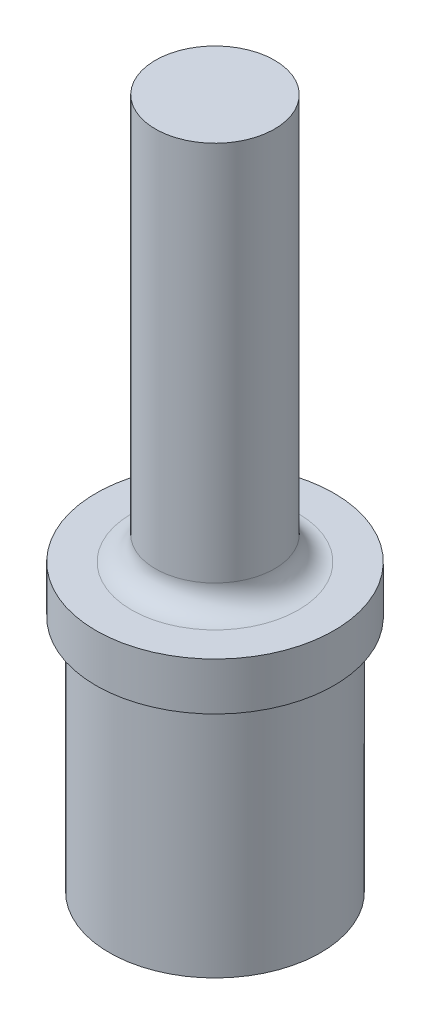
ISO-10303-21;
HEADER;
FILE_DESCRIPTION(('STEP AP214'),'2;1');
FILE_NAME('part.step','',(''),(''),'','','');
FILE_SCHEMA(('AUTOMOTIVE_DESIGN { 1 0 10303 214 1 1 1 1 }'));
ENDSEC;
DATA;
#1=APPLICATION_CONTEXT('core data for automotive mechanical design processes');
#2=APPLICATION_PROTOCOL_DEFINITION('international standard','automotive_design',2000,#1);
#3=PRODUCT_CONTEXT('',#1,'mechanical');
#4=PRODUCT('Part','Part','',(#3));
#5=PRODUCT_RELATED_PRODUCT_CATEGORY('part','',(#4));
#6=PRODUCT_DEFINITION_FORMATION('','',#4);
#7=PRODUCT_DEFINITION_CONTEXT('part definition',#1,'design');
#8=PRODUCT_DEFINITION('design','',#6,#7);
#9=PRODUCT_DEFINITION_SHAPE('','',#8);
#10=(LENGTH_UNIT() NAMED_UNIT(*) SI_UNIT(.MILLI.,.METRE.));
#11=(NAMED_UNIT(*) PLANE_ANGLE_UNIT() SI_UNIT($,.RADIAN.));
#12=(NAMED_UNIT(*) SI_UNIT($,.STERADIAN.) SOLID_ANGLE_UNIT());
#13=UNCERTAINTY_MEASURE_WITH_UNIT(LENGTH_MEASURE(1.E-05),#10,'distance_accuracy_value','');
#14=(GEOMETRIC_REPRESENTATION_CONTEXT(3) GLOBAL_UNCERTAINTY_ASSIGNED_CONTEXT((#13)) GLOBAL_UNIT_ASSIGNED_CONTEXT((#10,
#11,#12)) REPRESENTATION_CONTEXT('',''));
#15=CARTESIAN_POINT('',(0.,0.,0.));
#16=DIRECTION('',(0.,0.,1.));
#17=DIRECTION('',(1.,0.,0.));
#18=AXIS2_PLACEMENT_3D('',#15,#16,#17);
#19=CARTESIAN_POINT('',(0.,0.,0.));
#20=DIRECTION('',(0.,-1.,0.));
#21=DIRECTION('',(0.,0.,-1.));
#22=AXIS2_PLACEMENT_3D('',#19,#20,#21);
#23=PLANE('',#22);
#24=CARTESIAN_POINT('',(0.,0.,0.));
#25=DIRECTION('',(0.,-1.,0.));
#26=DIRECTION('',(0.,0.,-1.));
#27=AXIS2_PLACEMENT_3D('',#24,#25,#26);
#28=CIRCLE('',#27,3.9751);
#29=CARTESIAN_POINT('',(0.,0.,-3.9751));
#30=VERTEX_POINT('',#29);
#31=EDGE_CURVE('E78',#30,#30,#28,.T.);
#32=ORIENTED_EDGE('',*,*,#31,.F.);
#33=EDGE_LOOP('',(#32));
#34=FACE_BOUND('',#33,.T.);
#35=ADVANCED_FACE('F34',(#34),#23,.F.);
#36=CARTESIAN_POINT('',(0.,0.,0.));
#37=DIRECTION('',(0.,-1.,0.));
#38=DIRECTION('',(0.,0.,-1.));
#39=AXIS2_PLACEMENT_3D('',#36,#37,#38);
#40=CYLINDRICAL_SURFACE('',#39,3.9751);
#41=CARTESIAN_POINT('',(0.,-25.4,0.));
#42=DIRECTION('',(0.,-1.,0.));
#43=DIRECTION('',(0.,0.,-1.));
#44=AXIS2_PLACEMENT_3D('',#41,#42,#43);
#45=CIRCLE('',#44,3.9751);
#46=CARTESIAN_POINT('',(0.,-25.4,-3.9751));
#47=VERTEX_POINT('',#46);
#48=EDGE_CURVE('E11',#47,#47,#45,.F.);
#49=ORIENTED_EDGE('',*,*,#48,.T.);
#50=EDGE_LOOP('',(#49));
#51=FACE_BOUND('',#50,.T.);
#52=ORIENTED_EDGE('',*,*,#31,.T.);
#53=EDGE_LOOP('',(#52));
#54=FACE_BOUND('',#53,.T.);
#55=ADVANCED_FACE('F93',(#51,#54),#40,.T.);
#56=CARTESIAN_POINT('',(-3.9751,-26.9875,0.));
#57=DIRECTION('',(0.,-1.,0.));
#58=DIRECTION('',(0.,0.,-1.));
#59=AXIS2_PLACEMENT_3D('',#56,#57,#58);
#60=PLANE('',#59);
#61=CARTESIAN_POINT('',(0.,-26.9875,0.));
#62=DIRECTION('',(0.,-1.,0.));
#63=DIRECTION('',(0.,0.,-1.));
#64=AXIS2_PLACEMENT_3D('',#61,#62,#63);
#65=CIRCLE('',#64,5.5626);
#66=CARTESIAN_POINT('',(0.,-26.9875,-5.5626));
#67=VERTEX_POINT('',#66);
#68=EDGE_CURVE('E42',#67,#67,#65,.T.);
#69=ORIENTED_EDGE('',*,*,#68,.T.);
#70=EDGE_LOOP('',(#69));
#71=FACE_BOUND('',#70,.T.);
#72=CARTESIAN_POINT('',(0.,-26.9875,0.));
#73=DIRECTION('',(0.,-1.,0.));
#74=DIRECTION('',(0.,0.,-1.));
#75=AXIS2_PLACEMENT_3D('',#72,#73,#74);
#76=CIRCLE('',#75,7.9375);
#77=CARTESIAN_POINT('',(0.,-26.9875,-7.9375));
#78=VERTEX_POINT('',#77);
#79=EDGE_CURVE('E74',#78,#78,#76,.T.);
#80=ORIENTED_EDGE('',*,*,#79,.F.);
#81=EDGE_LOOP('',(#80));
#82=FACE_BOUND('',#81,.T.);
#83=ADVANCED_FACE('F84',(#71,#82),#60,.F.);
#84=CARTESIAN_POINT('',(0.,0.,0.));
#85=DIRECTION('',(0.,-1.,0.));
#86=DIRECTION('',(0.,0.,-1.));
#87=AXIS2_PLACEMENT_3D('',#84,#85,#86);
#88=CYLINDRICAL_SURFACE('',#87,7.9375);
#89=CARTESIAN_POINT('',(0.,-30.1625,0.));
#90=DIRECTION('',(0.,-1.,0.));
#91=DIRECTION('',(0.,0.,-1.));
#92=AXIS2_PLACEMENT_3D('',#89,#90,#91);
#93=CIRCLE('',#92,7.9375);
#94=CARTESIAN_POINT('',(0.,-30.1625,-7.9375));
#95=VERTEX_POINT('',#94);
#96=EDGE_CURVE('E70',#95,#95,#93,.T.);
#97=ORIENTED_EDGE('',*,*,#96,.F.);
#98=EDGE_LOOP('',(#97));
#99=FACE_BOUND('',#98,.T.);
#100=ORIENTED_EDGE('',*,*,#79,.T.);
#101=EDGE_LOOP('',(#100));
#102=FACE_BOUND('',#101,.T.);
#103=ADVANCED_FACE('F104',(#99,#102),#88,.T.);
#104=CARTESIAN_POINT('',(-7.9375,-30.1625,0.));
#105=DIRECTION('',(0.,1.,0.));
#106=DIRECTION('',(0.,0.,1.));
#107=AXIS2_PLACEMENT_3D('',#104,#105,#106);
#108=PLANE('',#107);
#109=CARTESIAN_POINT('',(0.,-30.1625,0.));
#110=DIRECTION('',(0.,-1.,0.));
#111=DIRECTION('',(0.,0.,-1.));
#112=AXIS2_PLACEMENT_3D('',#109,#110,#111);
#113=CIRCLE('',#112,7.0485);
#114=CARTESIAN_POINT('',(0.,-30.1625,-7.0485));
#115=VERTEX_POINT('',#114);
#116=EDGE_CURVE('E67',#115,#115,#113,.T.);
#117=ORIENTED_EDGE('',*,*,#116,.F.);
#118=EDGE_LOOP('',(#117));
#119=FACE_BOUND('',#118,.T.);
#120=ORIENTED_EDGE('',*,*,#96,.T.);
#121=EDGE_LOOP('',(#120));
#122=FACE_BOUND('',#121,.T.);
#123=ADVANCED_FACE('F107',(#119,#122),#108,.F.);
#124=CARTESIAN_POINT('',(0.,0.,0.));
#125=DIRECTION('',(0.,-1.,0.));
#126=DIRECTION('',(0.,0.,-1.));
#127=AXIS2_PLACEMENT_3D('',#124,#125,#126);
#128=CYLINDRICAL_SURFACE('',#127,7.0485);
#129=CARTESIAN_POINT('',(0.,-46.0375,0.));
#130=DIRECTION('',(0.,-1.,0.));
#131=DIRECTION('',(0.,0.,-1.));
#132=AXIS2_PLACEMENT_3D('',#129,#130,#131);
#133=CIRCLE('',#132,7.0485);
#134=CARTESIAN_POINT('',(0.,-46.0375,-7.0485));
#135=VERTEX_POINT('',#134);
#136=EDGE_CURVE('E62',#135,#135,#133,.T.);
#137=ORIENTED_EDGE('',*,*,#136,.F.);
#138=EDGE_LOOP('',(#137));
#139=FACE_BOUND('',#138,.T.);
#140=ORIENTED_EDGE('',*,*,#116,.T.);
#141=EDGE_LOOP('',(#140));
#142=FACE_BOUND('',#141,.T.);
#143=ADVANCED_FACE('F111',(#139,#142),#128,.T.);
#144=CARTESIAN_POINT('',(-7.0485,-46.0375,0.));
#145=DIRECTION('',(0.,1.,0.));
#146=DIRECTION('',(0.,0.,1.));
#147=AXIS2_PLACEMENT_3D('',#144,#145,#146);
#148=PLANE('',#147);
#149=CARTESIAN_POINT('',(0.,-46.0375,0.));
#150=DIRECTION('',(0.,-1.,0.));
#151=DIRECTION('',(0.,0.,-1.));
#152=AXIS2_PLACEMENT_3D('',#149,#150,#151);
#153=CIRCLE('',#152,5.7785);
#154=CARTESIAN_POINT('',(0.,-46.0375,-5.7785));
#155=VERTEX_POINT('',#154);
#156=EDGE_CURVE('E56',#155,#155,#153,.T.);
#157=ORIENTED_EDGE('',*,*,#156,.F.);
#158=EDGE_LOOP('',(#157));
#159=FACE_BOUND('',#158,.T.);
#160=ORIENTED_EDGE('',*,*,#136,.T.);
#161=EDGE_LOOP('',(#160));
#162=FACE_BOUND('',#161,.T.);
#163=ADVANCED_FACE('F115',(#159,#162),#148,.F.);
#164=CARTESIAN_POINT('',(0.,0.,0.));
#165=DIRECTION('',(0.,-1.,0.));
#166=DIRECTION('',(0.,0.,-1.));
#167=AXIS2_PLACEMENT_3D('',#164,#165,#166);
#168=CYLINDRICAL_SURFACE('',#167,5.7785);
#169=CARTESIAN_POINT('',(0.,-33.8699829508558,0.));
#170=DIRECTION('',(0.,-1.,0.));
#171=DIRECTION('',(0.,0.,-1.));
#172=AXIS2_PLACEMENT_3D('',#169,#170,#171);
#173=CIRCLE('',#172,5.7785);
#174=CARTESIAN_POINT('',(0.,-33.8699829508558,-5.7785));
#175=VERTEX_POINT('',#174);
#176=EDGE_CURVE('E53',#175,#175,#173,.T.);
#177=ORIENTED_EDGE('',*,*,#176,.F.);
#178=EDGE_LOOP('',(#177));
#179=FACE_BOUND('',#178,.T.);
#180=ORIENTED_EDGE('',*,*,#156,.T.);
#181=EDGE_LOOP('',(#180));
#182=FACE_BOUND('',#181,.T.);
#183=ADVANCED_FACE('F49',(#179,#182),#168,.F.);
#184=CARTESIAN_POINT('',(0.,-33.8699829508558,0.));
#185=DIRECTION('',(0.,-1.,0.));
#186=DIRECTION('',(0.,0.,-1.));
#187=AXIS2_PLACEMENT_3D('',#184,#185,#186);
#188=CONICAL_SURFACE('',#187,5.7785,1.08210413623649);
#189=CARTESIAN_POINT('',(0.,-30.7975,0.));
#190=VERTEX_POINT('',#189);
#191=VERTEX_LOOP('',#190);
#192=FACE_BOUND('',#191,.T.);
#193=ORIENTED_EDGE('',*,*,#176,.T.);
#194=EDGE_LOOP('',(#193));
#195=FACE_BOUND('',#194,.T.);
#196=ADVANCED_FACE('F46',(#192,#195),#188,.F.);
#197=CARTESIAN_POINT('',(0.,-25.4,0.));
#198=DIRECTION('',(0.,-1.,0.));
#199=DIRECTION('',(0.,0.,-1.));
#200=AXIS2_PLACEMENT_3D('',#197,#198,#199);
#201=TOROIDAL_SURFACE('',#200,5.5626,1.5875);
#202=ORIENTED_EDGE('',*,*,#48,.F.);
#203=EDGE_LOOP('',(#202));
#204=FACE_BOUND('',#203,.T.);
#205=ORIENTED_EDGE('',*,*,#68,.F.);
#206=EDGE_LOOP('',(#205));
#207=FACE_BOUND('',#206,.T.);
#208=ADVANCED_FACE('F36',(#204,#207),#201,.F.);
#209=CLOSED_SHELL('',(#35,#55,#83,#103,#123,#143,#163,#183,#196,#208));
#210=MANIFOLD_SOLID_BREP('B2',#209);
#211=ADVANCED_BREP_SHAPE_REPRESENTATION('',(#18,#210),#14);
#212=SHAPE_DEFINITION_REPRESENTATION(#9,#211);
ENDSEC;
END-ISO-10303-21;
